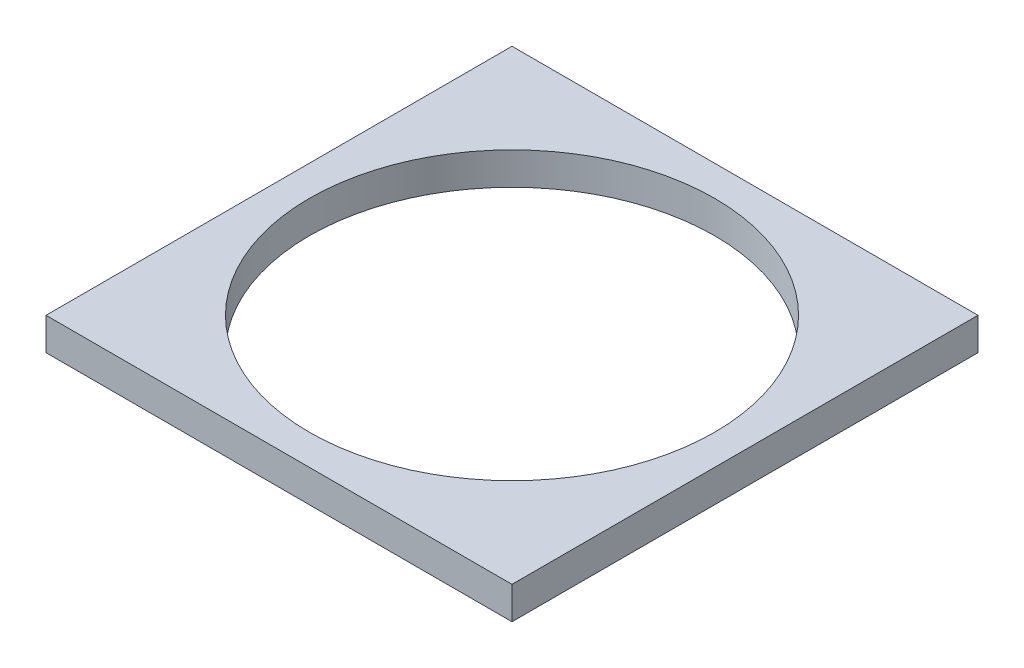
ISO-10303-21;
HEADER;
FILE_DESCRIPTION(('STEP AP214'),'2;1');
FILE_NAME('part.step','',(''),(''),'','','');
FILE_SCHEMA(('AUTOMOTIVE_DESIGN { 1 0 10303 214 1 1 1 1 }'));
ENDSEC;
DATA;
#1=APPLICATION_CONTEXT('core data for automotive mechanical design processes');
#2=APPLICATION_PROTOCOL_DEFINITION('international standard','automotive_design',2000,#1);
#3=PRODUCT_CONTEXT('',#1,'mechanical');
#4=PRODUCT('Part','Part','',(#3));
#5=PRODUCT_RELATED_PRODUCT_CATEGORY('part','',(#4));
#6=PRODUCT_DEFINITION_FORMATION('','',#4);
#7=PRODUCT_DEFINITION_CONTEXT('part definition',#1,'design');
#8=PRODUCT_DEFINITION('design','',#6,#7);
#9=PRODUCT_DEFINITION_SHAPE('','',#8);
#10=(LENGTH_UNIT() NAMED_UNIT(*) SI_UNIT(.MILLI.,.METRE.));
#11=(NAMED_UNIT(*) PLANE_ANGLE_UNIT() SI_UNIT($,.RADIAN.));
#12=(NAMED_UNIT(*) SI_UNIT($,.STERADIAN.) SOLID_ANGLE_UNIT());
#13=UNCERTAINTY_MEASURE_WITH_UNIT(LENGTH_MEASURE(1.E-05),#10,'distance_accuracy_value','');
#14=(GEOMETRIC_REPRESENTATION_CONTEXT(3) GLOBAL_UNCERTAINTY_ASSIGNED_CONTEXT((#13)) GLOBAL_UNIT_ASSIGNED_CONTEXT((#10,
#11,#12)) REPRESENTATION_CONTEXT('',''));
#15=CARTESIAN_POINT('',(0.,0.,0.));
#16=DIRECTION('',(0.,0.,1.));
#17=DIRECTION('',(1.,0.,0.));
#18=AXIS2_PLACEMENT_3D('',#15,#16,#17);
#19=CARTESIAN_POINT('',(0.,0.8,0.));
#20=DIRECTION('',(0.,1.,0.));
#21=DIRECTION('',(0.,0.,1.));
#22=AXIS2_PLACEMENT_3D('',#19,#20,#21);
#23=PLANE('',#22);
#24=DIRECTION('',(0.,0.,-1.));
#25=VECTOR('',#24,1.);
#26=CARTESIAN_POINT('',(2.55555555555556,0.8,-8.80753968253969));
#27=LINE('',#26,#25);
#28=CARTESIAN_POINT('',(2.55555555555556,0.8,2.69246031746032));
#29=VERTEX_POINT('',#28);
#30=CARTESIAN_POINT('',(2.55555555555556,0.8,-8.80753968253969));
#31=VERTEX_POINT('',#30);
#32=EDGE_CURVE('E96',#29,#31,#27,.T.);
#33=ORIENTED_EDGE('',*,*,#32,.T.);
#34=DIRECTION('',(-1.,0.,0.));
#35=VECTOR('',#34,1.);
#36=CARTESIAN_POINT('',(-8.94444444444444,0.8,-8.80753968253969));
#37=LINE('',#36,#35);
#38=CARTESIAN_POINT('',(-8.94444444444444,0.8,-8.80753968253969));
#39=VERTEX_POINT('',#38);
#40=EDGE_CURVE('E91',#31,#39,#37,.T.);
#41=ORIENTED_EDGE('',*,*,#40,.T.);
#42=DIRECTION('',(0.,0.,1.));
#43=VECTOR('',#42,1.);
#44=CARTESIAN_POINT('',(-8.94444444444444,0.8,-8.80753968253969));
#45=LINE('',#44,#43);
#46=CARTESIAN_POINT('',(-8.94444444444444,0.8,2.69246031746032));
#47=VERTEX_POINT('',#46);
#48=EDGE_CURVE('E94',#39,#47,#45,.T.);
#49=ORIENTED_EDGE('',*,*,#48,.T.);
#50=DIRECTION('',(1.,0.,0.));
#51=VECTOR('',#50,1.);
#52=CARTESIAN_POINT('',(-8.94444444444444,0.8,2.69246031746032));
#53=LINE('',#52,#51);
#54=EDGE_CURVE('E61',#47,#29,#53,.T.);
#55=ORIENTED_EDGE('',*,*,#54,.T.);
#56=EDGE_LOOP('',(#33,#41,#49,#55));
#57=FACE_BOUND('',#56,.T.);
#58=CARTESIAN_POINT('',(-3.19444444444444,0.8,-3.05753968253968));
#59=DIRECTION('',(0.,1.,0.));
#60=DIRECTION('',(0.,0.,1.));
#61=AXIS2_PLACEMENT_3D('',#58,#59,#60);
#62=CIRCLE('',#61,5.);
#63=CARTESIAN_POINT('',(-3.19444444444444,0.8,1.94246031746032));
#64=VERTEX_POINT('',#63);
#65=EDGE_CURVE('E116',#64,#64,#62,.T.);
#66=ORIENTED_EDGE('',*,*,#65,.F.);
#67=EDGE_LOOP('',(#66));
#68=FACE_BOUND('',#67,.T.);
#69=ADVANCED_FACE('F43',(#57,#68),#23,.T.);
#70=CARTESIAN_POINT('',(0.,0.,0.));
#71=DIRECTION('',(0.,1.,0.));
#72=DIRECTION('',(0.,0.,1.));
#73=AXIS2_PLACEMENT_3D('',#70,#71,#72);
#74=PLANE('',#73);
#75=DIRECTION('',(0.,0.,-1.));
#76=VECTOR('',#75,1.);
#77=CARTESIAN_POINT('',(2.55555555555556,0.,-8.80753968253969));
#78=LINE('',#77,#76);
#79=CARTESIAN_POINT('',(2.55555555555556,0.,2.69246031746032));
#80=VERTEX_POINT('',#79);
#81=CARTESIAN_POINT('',(2.55555555555556,0.,-8.80753968253969));
#82=VERTEX_POINT('',#81);
#83=EDGE_CURVE('E112',#80,#82,#78,.T.);
#84=ORIENTED_EDGE('',*,*,#83,.F.);
#85=DIRECTION('',(1.,0.,0.));
#86=VECTOR('',#85,1.);
#87=CARTESIAN_POINT('',(-8.94444444444444,0.,2.69246031746032));
#88=LINE('',#87,#86);
#89=CARTESIAN_POINT('',(-8.94444444444444,0.,2.69246031746032));
#90=VERTEX_POINT('',#89);
#91=EDGE_CURVE('E84',#90,#80,#88,.T.);
#92=ORIENTED_EDGE('',*,*,#91,.F.);
#93=DIRECTION('',(0.,0.,1.));
#94=VECTOR('',#93,1.);
#95=CARTESIAN_POINT('',(-8.94444444444444,0.,-8.80753968253969));
#96=LINE('',#95,#94);
#97=CARTESIAN_POINT('',(-8.94444444444444,0.,-8.80753968253969));
#98=VERTEX_POINT('',#97);
#99=EDGE_CURVE('E78',#98,#90,#96,.T.);
#100=ORIENTED_EDGE('',*,*,#99,.F.);
#101=DIRECTION('',(-1.,0.,0.));
#102=VECTOR('',#101,1.);
#103=CARTESIAN_POINT('',(-8.94444444444444,0.,-8.80753968253969));
#104=LINE('',#103,#102);
#105=EDGE_CURVE('E101',#82,#98,#104,.T.);
#106=ORIENTED_EDGE('',*,*,#105,.F.);
#107=EDGE_LOOP('',(#84,#92,#100,#106));
#108=FACE_BOUND('',#107,.T.);
#109=CARTESIAN_POINT('',(-3.19444444444444,0.,-3.05753968253968));
#110=DIRECTION('',(0.,1.,0.));
#111=DIRECTION('',(0.,0.,1.));
#112=AXIS2_PLACEMENT_3D('',#109,#110,#111);
#113=CIRCLE('',#112,5.);
#114=CARTESIAN_POINT('',(-3.19444444444444,0.,1.94246031746032));
#115=VERTEX_POINT('',#114);
#116=EDGE_CURVE('E134',#115,#115,#113,.T.);
#117=ORIENTED_EDGE('',*,*,#116,.T.);
#118=EDGE_LOOP('',(#117));
#119=FACE_BOUND('',#118,.T.);
#120=ADVANCED_FACE('F129',(#108,#119),#74,.F.);
#121=CARTESIAN_POINT('',(2.55555555555556,0.8,-8.80753968253969));
#122=DIRECTION('',(-1.,0.,0.));
#123=DIRECTION('',(0.,0.,1.));
#124=AXIS2_PLACEMENT_3D('',#121,#122,#123);
#125=PLANE('',#124);
#126=ORIENTED_EDGE('',*,*,#83,.T.);
#127=DIRECTION('',(0.,-1.,0.));
#128=VECTOR('',#127,1.);
#129=CARTESIAN_POINT('',(2.55555555555556,0.8,-8.80753968253969));
#130=LINE('',#129,#128);
#131=EDGE_CURVE('E11',#31,#82,#130,.T.);
#132=ORIENTED_EDGE('',*,*,#131,.F.);
#133=ORIENTED_EDGE('',*,*,#32,.F.);
#134=DIRECTION('',(0.,-1.,0.));
#135=VECTOR('',#134,1.);
#136=CARTESIAN_POINT('',(2.55555555555556,0.8,2.69246031746032));
#137=LINE('',#136,#135);
#138=EDGE_CURVE('E108',#29,#80,#137,.T.);
#139=ORIENTED_EDGE('',*,*,#138,.T.);
#140=EDGE_LOOP('',(#126,#132,#133,#139));
#141=FACE_BOUND('',#140,.T.);
#142=ADVANCED_FACE('F45',(#141),#125,.F.);
#143=CARTESIAN_POINT('',(-8.94444444444444,0.8,-8.80753968253969));
#144=DIRECTION('',(0.,0.,1.));
#145=DIRECTION('',(1.,0.,0.));
#146=AXIS2_PLACEMENT_3D('',#143,#144,#145);
#147=PLANE('',#146);
#148=ORIENTED_EDGE('',*,*,#105,.T.);
#149=DIRECTION('',(0.,-1.,0.));
#150=VECTOR('',#149,1.);
#151=CARTESIAN_POINT('',(-8.94444444444444,0.8,-8.80753968253969));
#152=LINE('',#151,#150);
#153=EDGE_CURVE('E53',#39,#98,#152,.T.);
#154=ORIENTED_EDGE('',*,*,#153,.F.);
#155=ORIENTED_EDGE('',*,*,#40,.F.);
#156=ORIENTED_EDGE('',*,*,#131,.T.);
#157=EDGE_LOOP('',(#148,#154,#155,#156));
#158=FACE_BOUND('',#157,.T.);
#159=ADVANCED_FACE('F100',(#158),#147,.F.);
#160=CARTESIAN_POINT('',(-8.94444444444444,0.8,-8.80753968253969));
#161=DIRECTION('',(1.,0.,0.));
#162=DIRECTION('',(0.,0.,-1.));
#163=AXIS2_PLACEMENT_3D('',#160,#161,#162);
#164=PLANE('',#163);
#165=ORIENTED_EDGE('',*,*,#99,.T.);
#166=DIRECTION('',(0.,-1.,0.));
#167=VECTOR('',#166,1.);
#168=CARTESIAN_POINT('',(-8.94444444444444,0.8,2.69246031746032));
#169=LINE('',#168,#167);
#170=EDGE_CURVE('E103',#47,#90,#169,.T.);
#171=ORIENTED_EDGE('',*,*,#170,.F.);
#172=ORIENTED_EDGE('',*,*,#48,.F.);
#173=ORIENTED_EDGE('',*,*,#153,.T.);
#174=EDGE_LOOP('',(#165,#171,#172,#173));
#175=FACE_BOUND('',#174,.T.);
#176=ADVANCED_FACE('F104',(#175),#164,.F.);
#177=CARTESIAN_POINT('',(-8.94444444444444,0.8,2.69246031746032));
#178=DIRECTION('',(0.,0.,-1.));
#179=DIRECTION('',(-1.,0.,0.));
#180=AXIS2_PLACEMENT_3D('',#177,#178,#179);
#181=PLANE('',#180);
#182=ORIENTED_EDGE('',*,*,#91,.T.);
#183=ORIENTED_EDGE('',*,*,#138,.F.);
#184=ORIENTED_EDGE('',*,*,#54,.F.);
#185=ORIENTED_EDGE('',*,*,#170,.T.);
#186=EDGE_LOOP('',(#182,#183,#184,#185));
#187=FACE_BOUND('',#186,.T.);
#188=ADVANCED_FACE('F126',(#187),#181,.F.);
#189=CARTESIAN_POINT('',(-3.19444444444444,0.8,-3.05753968253968));
#190=DIRECTION('',(0.,-1.,0.));
#191=DIRECTION('',(0.,0.,-1.));
#192=AXIS2_PLACEMENT_3D('',#189,#190,#191);
#193=CYLINDRICAL_SURFACE('',#192,5.);
#194=ORIENTED_EDGE('',*,*,#65,.T.);
#195=EDGE_LOOP('',(#194));
#196=FACE_BOUND('',#195,.T.);
#197=ORIENTED_EDGE('',*,*,#116,.F.);
#198=EDGE_LOOP('',(#197));
#199=FACE_BOUND('',#198,.T.);
#200=ADVANCED_FACE('F142',(#196,#199),#193,.F.);
#201=CLOSED_SHELL('',(#69,#120,#142,#159,#176,#188,#200));
#202=MANIFOLD_SOLID_BREP('B2',#201);
#203=ADVANCED_BREP_SHAPE_REPRESENTATION('',(#18,#202),#14);
#204=SHAPE_DEFINITION_REPRESENTATION(#9,#203);
ENDSEC;
END-ISO-10303-21;
